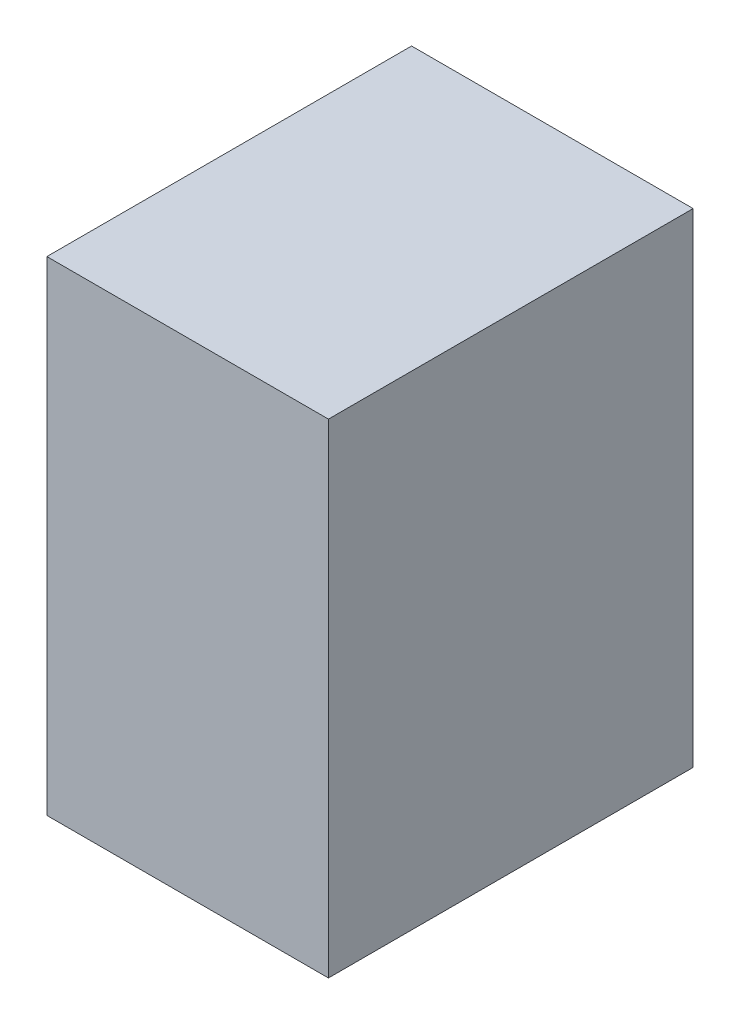
ISO-10303-21;
HEADER;
FILE_DESCRIPTION(('STEP AP214'),'2;1');
FILE_NAME('part.step','',(''),(''),'','','');
FILE_SCHEMA(('AUTOMOTIVE_DESIGN { 1 0 10303 214 1 1 1 1 }'));
ENDSEC;
DATA;
#1=APPLICATION_CONTEXT('core data for automotive mechanical design processes');
#2=APPLICATION_PROTOCOL_DEFINITION('international standard','automotive_design',2000,#1);
#3=PRODUCT_CONTEXT('',#1,'mechanical');
#4=PRODUCT('Part','Part','',(#3));
#5=PRODUCT_RELATED_PRODUCT_CATEGORY('part','',(#4));
#6=PRODUCT_DEFINITION_FORMATION('','',#4);
#7=PRODUCT_DEFINITION_CONTEXT('part definition',#1,'design');
#8=PRODUCT_DEFINITION('design','',#6,#7);
#9=PRODUCT_DEFINITION_SHAPE('','',#8);
#10=(LENGTH_UNIT() NAMED_UNIT(*) SI_UNIT(.MILLI.,.METRE.));
#11=(NAMED_UNIT(*) PLANE_ANGLE_UNIT() SI_UNIT($,.RADIAN.));
#12=(NAMED_UNIT(*) SI_UNIT($,.STERADIAN.) SOLID_ANGLE_UNIT());
#13=UNCERTAINTY_MEASURE_WITH_UNIT(LENGTH_MEASURE(1.E-05),#10,'distance_accuracy_value','');
#14=(GEOMETRIC_REPRESENTATION_CONTEXT(3) GLOBAL_UNCERTAINTY_ASSIGNED_CONTEXT((#13)) GLOBAL_UNIT_ASSIGNED_CONTEXT((#10,
#11,#12)) REPRESENTATION_CONTEXT('',''));
#15=CARTESIAN_POINT('',(0.,0.,0.));
#16=DIRECTION('',(0.,0.,1.));
#17=DIRECTION('',(1.,0.,0.));
#18=AXIS2_PLACEMENT_3D('',#15,#16,#17);
#19=CARTESIAN_POINT('',(-1276.35708742465,361.,-2590.62516254778));
#20=DIRECTION('',(1.,0.,0.));
#21=DIRECTION('',(0.,0.,-1.));
#22=AXIS2_PLACEMENT_3D('',#19,#20,#21);
#23=PLANE('',#22);
#24=DIRECTION('',(0.,0.,1.));
#25=VECTOR('',#24,1.);
#26=CARTESIAN_POINT('',(-1276.35708742465,0.,-2590.62516254778));
#27=LINE('',#26,#25);
#28=CARTESIAN_POINT('',(-1276.35708742465,0.,-2590.62516254778));
#29=VERTEX_POINT('',#28);
#30=CARTESIAN_POINT('',(-1276.35708742465,0.,-2318.62516254778));
#31=VERTEX_POINT('',#30);
#32=EDGE_CURVE('E98',#29,#31,#27,.T.);
#33=ORIENTED_EDGE('',*,*,#32,.T.);
#34=DIRECTION('',(0.,-1.,0.));
#35=VECTOR('',#34,1.);
#36=CARTESIAN_POINT('',(-1276.35708742465,361.,-2318.62516254778));
#37=LINE('',#36,#35);
#38=CARTESIAN_POINT('',(-1276.35708742465,361.,-2318.62516254778));
#39=VERTEX_POINT('',#38);
#40=EDGE_CURVE('E11',#39,#31,#37,.T.);
#41=ORIENTED_EDGE('',*,*,#40,.F.);
#42=DIRECTION('',(0.,0.,1.));
#43=VECTOR('',#42,1.);
#44=CARTESIAN_POINT('',(-1276.35708742465,361.,-2590.62516254778));
#45=LINE('',#44,#43);
#46=CARTESIAN_POINT('',(-1276.35708742465,361.,-2590.62516254778));
#47=VERTEX_POINT('',#46);
#48=EDGE_CURVE('E86',#47,#39,#45,.T.);
#49=ORIENTED_EDGE('',*,*,#48,.F.);
#50=DIRECTION('',(0.,-1.,0.));
#51=VECTOR('',#50,1.);
#52=CARTESIAN_POINT('',(-1276.35708742465,361.,-2590.62516254778));
#53=LINE('',#52,#51);
#54=EDGE_CURVE('E94',#47,#29,#53,.T.);
#55=ORIENTED_EDGE('',*,*,#54,.T.);
#56=EDGE_LOOP('',(#33,#41,#49,#55));
#57=FACE_BOUND('',#56,.T.);
#58=ADVANCED_FACE('F35',(#57),#23,.F.);
#59=CARTESIAN_POINT('',(-1276.35708742465,361.,-2318.62516254778));
#60=DIRECTION('',(0.,0.,-1.));
#61=DIRECTION('',(-1.,0.,0.));
#62=AXIS2_PLACEMENT_3D('',#59,#60,#61);
#63=PLANE('',#62);
#64=DIRECTION('',(1.,0.,0.));
#65=VECTOR('',#64,1.);
#66=CARTESIAN_POINT('',(-1276.35708742465,0.,-2318.62516254778));
#67=LINE('',#66,#65);
#68=CARTESIAN_POINT('',(-1066.35708742465,0.,-2318.62516254778));
#69=VERTEX_POINT('',#68);
#70=EDGE_CURVE('E90',#31,#69,#67,.T.);
#71=ORIENTED_EDGE('',*,*,#70,.T.);
#72=DIRECTION('',(0.,-1.,0.));
#73=VECTOR('',#72,1.);
#74=CARTESIAN_POINT('',(-1066.35708742465,361.,-2318.62516254778));
#75=LINE('',#74,#73);
#76=CARTESIAN_POINT('',(-1066.35708742465,361.,-2318.62516254778));
#77=VERTEX_POINT('',#76);
#78=EDGE_CURVE('E43',#77,#69,#75,.T.);
#79=ORIENTED_EDGE('',*,*,#78,.F.);
#80=DIRECTION('',(1.,0.,0.));
#81=VECTOR('',#80,1.);
#82=CARTESIAN_POINT('',(-1276.35708742465,361.,-2318.62516254778));
#83=LINE('',#82,#81);
#84=EDGE_CURVE('E81',#39,#77,#83,.T.);
#85=ORIENTED_EDGE('',*,*,#84,.F.);
#86=ORIENTED_EDGE('',*,*,#40,.T.);
#87=EDGE_LOOP('',(#71,#79,#85,#86));
#88=FACE_BOUND('',#87,.T.);
#89=ADVANCED_FACE('F89',(#88),#63,.F.);
#90=CARTESIAN_POINT('',(-1066.35708742465,361.,-2590.62516254778));
#91=DIRECTION('',(-1.,0.,0.));
#92=DIRECTION('',(0.,0.,1.));
#93=AXIS2_PLACEMENT_3D('',#90,#91,#92);
#94=PLANE('',#93);
#95=DIRECTION('',(0.,0.,-1.));
#96=VECTOR('',#95,1.);
#97=CARTESIAN_POINT('',(-1066.35708742465,0.,-2590.62516254778));
#98=LINE('',#97,#96);
#99=CARTESIAN_POINT('',(-1066.35708742465,0.,-2590.62516254778));
#100=VERTEX_POINT('',#99);
#101=EDGE_CURVE('E68',#69,#100,#98,.T.);
#102=ORIENTED_EDGE('',*,*,#101,.T.);
#103=DIRECTION('',(0.,-1.,0.));
#104=VECTOR('',#103,1.);
#105=CARTESIAN_POINT('',(-1066.35708742465,361.,-2590.62516254778));
#106=LINE('',#105,#104);
#107=CARTESIAN_POINT('',(-1066.35708742465,361.,-2590.62516254778));
#108=VERTEX_POINT('',#107);
#109=EDGE_CURVE('E91',#108,#100,#106,.T.);
#110=ORIENTED_EDGE('',*,*,#109,.F.);
#111=DIRECTION('',(0.,0.,-1.));
#112=VECTOR('',#111,1.);
#113=CARTESIAN_POINT('',(-1066.35708742465,361.,-2590.62516254778));
#114=LINE('',#113,#112);
#115=EDGE_CURVE('E84',#77,#108,#114,.T.);
#116=ORIENTED_EDGE('',*,*,#115,.F.);
#117=ORIENTED_EDGE('',*,*,#78,.T.);
#118=EDGE_LOOP('',(#102,#110,#116,#117));
#119=FACE_BOUND('',#118,.T.);
#120=ADVANCED_FACE('F92',(#119),#94,.F.);
#121=CARTESIAN_POINT('',(-1276.35708742465,361.,-2590.62516254778));
#122=DIRECTION('',(0.,0.,1.));
#123=DIRECTION('',(1.,0.,0.));
#124=AXIS2_PLACEMENT_3D('',#121,#122,#123);
#125=PLANE('',#124);
#126=DIRECTION('',(-1.,0.,0.));
#127=VECTOR('',#126,1.);
#128=CARTESIAN_POINT('',(-1276.35708742465,0.,-2590.62516254778));
#129=LINE('',#128,#127);
#130=EDGE_CURVE('E74',#100,#29,#129,.T.);
#131=ORIENTED_EDGE('',*,*,#130,.T.);
#132=ORIENTED_EDGE('',*,*,#54,.F.);
#133=DIRECTION('',(-1.,0.,0.));
#134=VECTOR('',#133,1.);
#135=CARTESIAN_POINT('',(-1276.35708742465,361.,-2590.62516254778));
#136=LINE('',#135,#134);
#137=EDGE_CURVE('E51',#108,#47,#136,.T.);
#138=ORIENTED_EDGE('',*,*,#137,.F.);
#139=ORIENTED_EDGE('',*,*,#109,.T.);
#140=EDGE_LOOP('',(#131,#132,#138,#139));
#141=FACE_BOUND('',#140,.T.);
#142=ADVANCED_FACE('F105',(#141),#125,.F.);
#143=CARTESIAN_POINT('',(0.,361.,0.));
#144=DIRECTION('',(0.,1.,0.));
#145=DIRECTION('',(0.,0.,1.));
#146=AXIS2_PLACEMENT_3D('',#143,#144,#145);
#147=PLANE('',#146);
#148=ORIENTED_EDGE('',*,*,#48,.T.);
#149=ORIENTED_EDGE('',*,*,#84,.T.);
#150=ORIENTED_EDGE('',*,*,#115,.T.);
#151=ORIENTED_EDGE('',*,*,#137,.T.);
#152=EDGE_LOOP('',(#148,#149,#150,#151));
#153=FACE_BOUND('',#152,.T.);
#154=ADVANCED_FACE('F82',(#153),#147,.T.);
#155=CARTESIAN_POINT('',(0.,0.,0.));
#156=DIRECTION('',(0.,1.,0.));
#157=DIRECTION('',(0.,0.,1.));
#158=AXIS2_PLACEMENT_3D('',#155,#156,#157);
#159=PLANE('',#158);
#160=ORIENTED_EDGE('',*,*,#32,.F.);
#161=ORIENTED_EDGE('',*,*,#130,.F.);
#162=ORIENTED_EDGE('',*,*,#101,.F.);
#163=ORIENTED_EDGE('',*,*,#70,.F.);
#164=EDGE_LOOP('',(#160,#161,#162,#163));
#165=FACE_BOUND('',#164,.T.);
#166=ADVANCED_FACE('F108',(#165),#159,.F.);
#167=CLOSED_SHELL('',(#58,#89,#120,#142,#154,#166));
#168=MANIFOLD_SOLID_BREP('B2',#167);
#169=ADVANCED_BREP_SHAPE_REPRESENTATION('',(#18,#168),#14);
#170=SHAPE_DEFINITION_REPRESENTATION(#9,#169);
ENDSEC;
END-ISO-10303-21;
